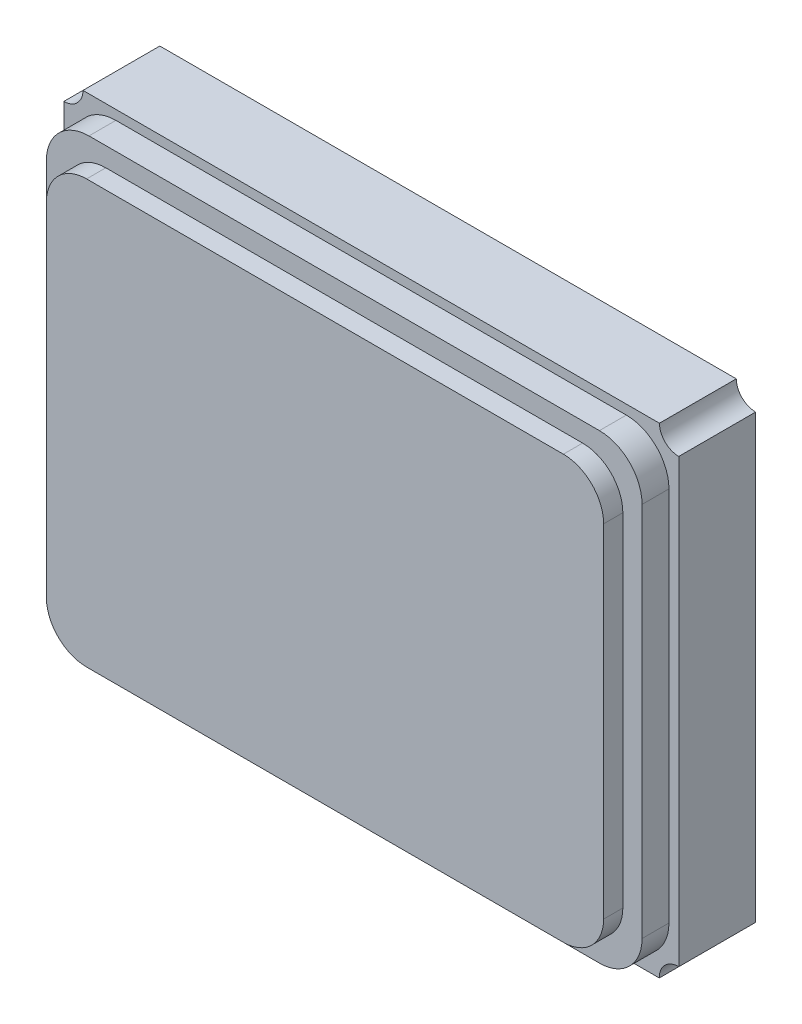
ISO-10303-21;
HEADER;
FILE_DESCRIPTION(('STEP AP214'),'2;1');
FILE_NAME('part.step','',(''),(''),'','','');
FILE_SCHEMA(('AUTOMOTIVE_DESIGN { 1 0 10303 214 1 1 1 1 }'));
ENDSEC;
DATA;
#1=APPLICATION_CONTEXT('core data for automotive mechanical design processes');
#2=APPLICATION_PROTOCOL_DEFINITION('international standard','automotive_design',2000,#1);
#3=PRODUCT_CONTEXT('',#1,'mechanical');
#4=PRODUCT('Part','Part','',(#3));
#5=PRODUCT_RELATED_PRODUCT_CATEGORY('part','',(#4));
#6=PRODUCT_DEFINITION_FORMATION('','',#4);
#7=PRODUCT_DEFINITION_CONTEXT('part definition',#1,'design');
#8=PRODUCT_DEFINITION('design','',#6,#7);
#9=PRODUCT_DEFINITION_SHAPE('','',#8);
#10=(LENGTH_UNIT() NAMED_UNIT(*) SI_UNIT(.MILLI.,.METRE.));
#11=(NAMED_UNIT(*) PLANE_ANGLE_UNIT() SI_UNIT($,.RADIAN.));
#12=(NAMED_UNIT(*) SI_UNIT($,.STERADIAN.) SOLID_ANGLE_UNIT());
#13=UNCERTAINTY_MEASURE_WITH_UNIT(LENGTH_MEASURE(1.E-05),#10,'distance_accuracy_value','');
#14=(GEOMETRIC_REPRESENTATION_CONTEXT(3) GLOBAL_UNCERTAINTY_ASSIGNED_CONTEXT((#13)) GLOBAL_UNIT_ASSIGNED_CONTEXT((#10,
#11,#12)) REPRESENTATION_CONTEXT('',''));
#15=CARTESIAN_POINT('',(0.,0.,0.));
#16=DIRECTION('',(0.,0.,1.));
#17=DIRECTION('',(1.,0.,0.));
#18=AXIS2_PLACEMENT_3D('',#15,#16,#17);
#19=CARTESIAN_POINT('',(0.0008802163144183,-0.0008850774637298,0.));
#20=DIRECTION('',(0.,0.,1.));
#21=DIRECTION('',(1.,0.,0.));
#22=AXIS2_PLACEMENT_3D('',#19,#20,#21);
#23=PLANE('',#22);
#24=DIRECTION('',(1.,0.,0.));
#25=VECTOR('',#24,1.);
#26=CARTESIAN_POINT('',(-1.499580396422,1.249506131818,0.));
#27=LINE('',#26,#25);
#28=CARTESIAN_POINT('',(-1.499580396422,1.249506131818,0.));
#29=VERTEX_POINT('',#28);
#30=CARTESIAN_POINT('',(1.500419603578,1.249506131818,0.));
#31=VERTEX_POINT('',#30);
#32=EDGE_CURVE('E376',#29,#31,#27,.T.);
#33=ORIENTED_EDGE('',*,*,#32,.T.);
#34=CARTESIAN_POINT('',(1.600419603578,1.250214196517,0.));
#35=DIRECTION('',(0.,0.,1.));
#36=DIRECTION('',(1.,0.,0.));
#37=AXIS2_PLACEMENT_3D('',#34,#35,#36);
#38=CIRCLE('',#37,0.100002506747);
#39=CARTESIAN_POINT('',(1.601127668277,1.150214196517,0.));
#40=VERTEX_POINT('',#39);
#41=EDGE_CURVE('E147',#31,#40,#38,.T.);
#42=ORIENTED_EDGE('',*,*,#41,.T.);
#43=DIRECTION('',(0.,-1.,0.));
#44=VECTOR('',#43,1.);
#45=CARTESIAN_POINT('',(1.601127668277,1.150214196517,0.));
#46=LINE('',#45,#44);
#47=CARTESIAN_POINT('',(1.601127668277,-1.149785803483,0.));
#48=VERTEX_POINT('',#47);
#49=EDGE_CURVE('E357',#40,#48,#46,.T.);
#50=ORIENTED_EDGE('',*,*,#49,.T.);
#51=CARTESIAN_POINT('',(1.599580396422,-1.249785803483,0.));
#52=DIRECTION('',(0.,0.,1.));
#53=DIRECTION('',(1.,0.,0.));
#54=AXIS2_PLACEMENT_3D('',#51,#52,#53);
#55=CIRCLE('',#54,0.100011969535);
#56=CARTESIAN_POINT('',(1.499580396422,-1.251333075338,0.));
#57=VERTEX_POINT('',#56);
#58=EDGE_CURVE('E28',#48,#57,#55,.T.);
#59=ORIENTED_EDGE('',*,*,#58,.T.);
#60=DIRECTION('',(-1.,0.,0.));
#61=VECTOR('',#60,1.);
#62=CARTESIAN_POINT('',(1.499580396422,-1.251333075338,0.));
#63=LINE('',#62,#61);
#64=CARTESIAN_POINT('',(-1.500419603578,-1.251333075338,0.));
#65=VERTEX_POINT('',#64);
#66=EDGE_CURVE('E11',#57,#65,#63,.T.);
#67=ORIENTED_EDGE('',*,*,#66,.T.);
#68=CARTESIAN_POINT('',(-1.600419603578,-1.250214196517,0.));
#69=DIRECTION('',(0.,0.,1.));
#70=DIRECTION('',(1.,0.,0.));
#71=AXIS2_PLACEMENT_3D('',#68,#69,#70);
#72=CIRCLE('',#71,0.100006259253);
#73=CARTESIAN_POINT('',(-1.599300724757,-1.150214196517,0.));
#74=VERTEX_POINT('',#73);
#75=EDGE_CURVE('E324',#65,#74,#72,.T.);
#76=ORIENTED_EDGE('',*,*,#75,.T.);
#77=DIRECTION('',(0.,1.,0.));
#78=VECTOR('',#77,1.);
#79=CARTESIAN_POINT('',(-1.599300724757,-1.150214196517,0.));
#80=LINE('',#79,#78);
#81=CARTESIAN_POINT('',(-1.599300724757,1.149785803483,0.));
#82=VERTEX_POINT('',#81);
#83=EDGE_CURVE('E349',#74,#82,#80,.T.);
#84=ORIENTED_EDGE('',*,*,#83,.T.);
#85=CARTESIAN_POINT('',(-1.599580396422,1.249785803483,0.));
#86=DIRECTION('',(0.,0.,1.));
#87=DIRECTION('',(1.,0.,0.));
#88=AXIS2_PLACEMENT_3D('',#85,#86,#87);
#89=CIRCLE('',#88,0.10000039108);
#90=EDGE_CURVE('E158',#82,#29,#89,.T.);
#91=ORIENTED_EDGE('',*,*,#90,.T.);
#92=EDGE_LOOP('',(#33,#42,#50,#59,#67,#76,#84,#91));
#93=FACE_BOUND('',#92,.T.);
#94=ADVANCED_FACE('F17',(#93),#23,.F.);
#95=CARTESIAN_POINT('',(1.499580396422,-1.251333075338,0.));
#96=DIRECTION('',(0.,-1.,0.));
#97=DIRECTION('',(0.,0.,-1.));
#98=AXIS2_PLACEMENT_3D('',#95,#96,#97);
#99=PLANE('',#98);
#100=DIRECTION('',(0.,0.,1.));
#101=VECTOR('',#100,1.);
#102=CARTESIAN_POINT('',(1.499580396422,-1.251333075338,0.));
#103=LINE('',#102,#101);
#104=CARTESIAN_POINT('',(1.499580396422,-1.251333075338,0.4));
#105=VERTEX_POINT('',#104);
#106=EDGE_CURVE('E174',#57,#105,#103,.T.);
#107=ORIENTED_EDGE('',*,*,#106,.T.);
#108=DIRECTION('',(-1.,0.,0.));
#109=VECTOR('',#108,1.);
#110=CARTESIAN_POINT('',(1.499580396422,-1.251333075338,0.4));
#111=LINE('',#110,#109);
#112=CARTESIAN_POINT('',(-1.500419603578,-1.251333075338,0.4));
#113=VERTEX_POINT('',#112);
#114=EDGE_CURVE('E304',#105,#113,#111,.T.);
#115=ORIENTED_EDGE('',*,*,#114,.T.);
#116=DIRECTION('',(0.,0.,1.));
#117=VECTOR('',#116,1.);
#118=CARTESIAN_POINT('',(-1.500419603578,-1.251333075338,0.));
#119=LINE('',#118,#117);
#120=EDGE_CURVE('E21',#65,#113,#119,.T.);
#121=ORIENTED_EDGE('',*,*,#120,.F.);
#122=ORIENTED_EDGE('',*,*,#66,.F.);
#123=EDGE_LOOP('',(#107,#115,#121,#122));
#124=FACE_BOUND('',#123,.T.);
#125=ADVANCED_FACE('F599',(#124),#99,.T.);
#126=CARTESIAN_POINT('',(1.599580396422,-1.249785803483,0.));
#127=DIRECTION('',(0.,0.,-1.));
#128=DIRECTION('',(1.,0.,0.));
#129=AXIS2_PLACEMENT_3D('',#126,#127,#128);
#130=CYLINDRICAL_SURFACE('',#129,0.100011969535);
#131=DIRECTION('',(0.,0.,1.));
#132=VECTOR('',#131,1.);
#133=CARTESIAN_POINT('',(1.601127668277,-1.149785803483,0.));
#134=LINE('',#133,#132);
#135=CARTESIAN_POINT('',(1.601127668277,-1.149785803483,0.4));
#136=VERTEX_POINT('',#135);
#137=EDGE_CURVE('E354',#48,#136,#134,.T.);
#138=ORIENTED_EDGE('',*,*,#137,.T.);
#139=CARTESIAN_POINT('',(1.599580396422,-1.249785803483,0.4));
#140=DIRECTION('',(0.,0.,1.));
#141=DIRECTION('',(1.,0.,0.));
#142=AXIS2_PLACEMENT_3D('',#139,#140,#141);
#143=CIRCLE('',#142,0.100011969535);
#144=EDGE_CURVE('E307',#136,#105,#143,.T.);
#145=ORIENTED_EDGE('',*,*,#144,.T.);
#146=ORIENTED_EDGE('',*,*,#106,.F.);
#147=ORIENTED_EDGE('',*,*,#58,.F.);
#148=EDGE_LOOP('',(#138,#145,#146,#147));
#149=FACE_BOUND('',#148,.T.);
#150=ADVANCED_FACE('F604',(#149),#130,.F.);
#151=CARTESIAN_POINT('',(-1.600419603578,-1.250214196517,0.));
#152=DIRECTION('',(0.,0.,-1.));
#153=DIRECTION('',(1.,0.,0.));
#154=AXIS2_PLACEMENT_3D('',#151,#152,#153);
#155=CYLINDRICAL_SURFACE('',#154,0.100006259253);
#156=ORIENTED_EDGE('',*,*,#120,.T.);
#157=CARTESIAN_POINT('',(-1.600419603578,-1.250214196517,0.4));
#158=DIRECTION('',(0.,0.,1.));
#159=DIRECTION('',(1.,0.,0.));
#160=AXIS2_PLACEMENT_3D('',#157,#158,#159);
#161=CIRCLE('',#160,0.100006259253);
#162=CARTESIAN_POINT('',(-1.599300724757,-1.150214196517,0.4));
#163=VERTEX_POINT('',#162);
#164=EDGE_CURVE('E308',#113,#163,#161,.T.);
#165=ORIENTED_EDGE('',*,*,#164,.T.);
#166=DIRECTION('',(0.,0.,1.));
#167=VECTOR('',#166,1.);
#168=CARTESIAN_POINT('',(-1.599300724757,-1.150214196517,0.));
#169=LINE('',#168,#167);
#170=EDGE_CURVE('E346',#74,#163,#169,.T.);
#171=ORIENTED_EDGE('',*,*,#170,.F.);
#172=ORIENTED_EDGE('',*,*,#75,.F.);
#173=EDGE_LOOP('',(#156,#165,#171,#172));
#174=FACE_BOUND('',#173,.T.);
#175=ADVANCED_FACE('F629',(#174),#155,.F.);
#176=CARTESIAN_POINT('',(1.601127668277,1.150214196517,0.));
#177=DIRECTION('',(1.,0.,0.));
#178=DIRECTION('',(0.,1.,0.));
#179=AXIS2_PLACEMENT_3D('',#176,#177,#178);
#180=PLANE('',#179);
#181=DIRECTION('',(0.,0.,1.));
#182=VECTOR('',#181,1.);
#183=CARTESIAN_POINT('',(1.601127668277,1.150214196517,0.));
#184=LINE('',#183,#182);
#185=CARTESIAN_POINT('',(1.601127668277,1.150214196517,0.4));
#186=VERTEX_POINT('',#185);
#187=EDGE_CURVE('E319',#40,#186,#184,.T.);
#188=ORIENTED_EDGE('',*,*,#187,.T.);
#189=DIRECTION('',(0.,-1.,0.));
#190=VECTOR('',#189,1.);
#191=CARTESIAN_POINT('',(1.601127668277,1.150214196517,0.4));
#192=LINE('',#191,#190);
#193=EDGE_CURVE('E314',#186,#136,#192,.T.);
#194=ORIENTED_EDGE('',*,*,#193,.T.);
#195=ORIENTED_EDGE('',*,*,#137,.F.);
#196=ORIENTED_EDGE('',*,*,#49,.F.);
#197=EDGE_LOOP('',(#188,#194,#195,#196));
#198=FACE_BOUND('',#197,.T.);
#199=ADVANCED_FACE('F608',(#198),#180,.T.);
#200=CARTESIAN_POINT('',(-1.599300724757,-1.150214196517,0.));
#201=DIRECTION('',(-1.,0.,0.));
#202=DIRECTION('',(0.,0.,1.));
#203=AXIS2_PLACEMENT_3D('',#200,#201,#202);
#204=PLANE('',#203);
#205=ORIENTED_EDGE('',*,*,#170,.T.);
#206=DIRECTION('',(0.,1.,0.));
#207=VECTOR('',#206,1.);
#208=CARTESIAN_POINT('',(-1.599300724757,-1.150214196517,0.4));
#209=LINE('',#208,#207);
#210=CARTESIAN_POINT('',(-1.599300724757,1.149785803483,0.4));
#211=VERTEX_POINT('',#210);
#212=EDGE_CURVE('E362',#163,#211,#209,.T.);
#213=ORIENTED_EDGE('',*,*,#212,.T.);
#214=DIRECTION('',(0.,0.,1.));
#215=VECTOR('',#214,1.);
#216=CARTESIAN_POINT('',(-1.599300724757,1.149785803483,0.));
#217=LINE('',#216,#215);
#218=EDGE_CURVE('E379',#82,#211,#217,.T.);
#219=ORIENTED_EDGE('',*,*,#218,.F.);
#220=ORIENTED_EDGE('',*,*,#83,.F.);
#221=EDGE_LOOP('',(#205,#213,#219,#220));
#222=FACE_BOUND('',#221,.T.);
#223=ADVANCED_FACE('F644',(#222),#204,.T.);
#224=CARTESIAN_POINT('',(1.600419603578,1.250214196517,0.));
#225=DIRECTION('',(0.,0.,-1.));
#226=DIRECTION('',(1.,0.,0.));
#227=AXIS2_PLACEMENT_3D('',#224,#225,#226);
#228=CYLINDRICAL_SURFACE('',#227,0.100002506747);
#229=DIRECTION('',(0.,0.,1.));
#230=VECTOR('',#229,1.);
#231=CARTESIAN_POINT('',(1.500419603578,1.249506131818,0.));
#232=LINE('',#231,#230);
#233=CARTESIAN_POINT('',(1.500419603578,1.249506131818,0.4));
#234=VERTEX_POINT('',#233);
#235=EDGE_CURVE('E380',#31,#234,#232,.T.);
#236=ORIENTED_EDGE('',*,*,#235,.T.);
#237=CARTESIAN_POINT('',(1.600419603578,1.250214196517,0.4));
#238=DIRECTION('',(0.,0.,1.));
#239=DIRECTION('',(1.,0.,0.));
#240=AXIS2_PLACEMENT_3D('',#237,#238,#239);
#241=CIRCLE('',#240,0.100002506747);
#242=EDGE_CURVE('E318',#234,#186,#241,.T.);
#243=ORIENTED_EDGE('',*,*,#242,.T.);
#244=ORIENTED_EDGE('',*,*,#187,.F.);
#245=ORIENTED_EDGE('',*,*,#41,.F.);
#246=EDGE_LOOP('',(#236,#243,#244,#245));
#247=FACE_BOUND('',#246,.T.);
#248=ADVANCED_FACE('F466',(#247),#228,.F.);
#249=CARTESIAN_POINT('',(-1.599580396422,1.249785803483,0.));
#250=DIRECTION('',(0.,0.,-1.));
#251=DIRECTION('',(1.,0.,0.));
#252=AXIS2_PLACEMENT_3D('',#249,#250,#251);
#253=CYLINDRICAL_SURFACE('',#252,0.10000039108);
#254=ORIENTED_EDGE('',*,*,#218,.T.);
#255=CARTESIAN_POINT('',(-1.599580396422,1.249785803483,0.4));
#256=DIRECTION('',(0.,0.,1.));
#257=DIRECTION('',(1.,0.,0.));
#258=AXIS2_PLACEMENT_3D('',#255,#256,#257);
#259=CIRCLE('',#258,0.10000039108);
#260=CARTESIAN_POINT('',(-1.499580396422,1.249506131818,0.4));
#261=VERTEX_POINT('',#260);
#262=EDGE_CURVE('E358',#211,#261,#259,.T.);
#263=ORIENTED_EDGE('',*,*,#262,.T.);
#264=DIRECTION('',(0.,0.,1.));
#265=VECTOR('',#264,1.);
#266=CARTESIAN_POINT('',(-1.499580396422,1.249506131818,0.));
#267=LINE('',#266,#265);
#268=EDGE_CURVE('E395',#29,#261,#267,.T.);
#269=ORIENTED_EDGE('',*,*,#268,.F.);
#270=ORIENTED_EDGE('',*,*,#90,.F.);
#271=EDGE_LOOP('',(#254,#263,#269,#270));
#272=FACE_BOUND('',#271,.T.);
#273=ADVANCED_FACE('F477',(#272),#253,.F.);
#274=CARTESIAN_POINT('',(-1.499580396422,1.249506131818,0.));
#275=DIRECTION('',(0.,1.,0.));
#276=DIRECTION('',(1.,0.,0.));
#277=AXIS2_PLACEMENT_3D('',#274,#275,#276);
#278=PLANE('',#277);
#279=ORIENTED_EDGE('',*,*,#268,.T.);
#280=DIRECTION('',(1.,0.,0.));
#281=VECTOR('',#280,1.);
#282=CARTESIAN_POINT('',(-1.499580396422,1.249506131818,0.4));
#283=LINE('',#282,#281);
#284=EDGE_CURVE('E363',#261,#234,#283,.T.);
#285=ORIENTED_EDGE('',*,*,#284,.T.);
#286=ORIENTED_EDGE('',*,*,#235,.F.);
#287=ORIENTED_EDGE('',*,*,#32,.F.);
#288=EDGE_LOOP('',(#279,#285,#286,#287));
#289=FACE_BOUND('',#288,.T.);
#290=ADVANCED_FACE('F474',(#289),#278,.T.);
#291=CARTESIAN_POINT('',(0.0008802163144183,-0.0008850774637298,0.4));
#292=DIRECTION('',(0.,0.,1.));
#293=DIRECTION('',(1.,0.,0.));
#294=AXIS2_PLACEMENT_3D('',#291,#292,#293);
#295=PLANE('',#294);
#296=CARTESIAN_POINT('',(1.328205850256,-0.978205850256,0.4));
#297=DIRECTION('',(0.,0.,-1.));
#298=DIRECTION('',(1.,0.,0.));
#299=AXIS2_PLACEMENT_3D('',#296,#297,#298);
#300=CIRCLE('',#299,0.221794149744);
#301=CARTESIAN_POINT('',(1.55,-0.978205850256,0.4));
#302=VERTEX_POINT('',#301);
#303=CARTESIAN_POINT('',(1.328205850256,-1.2,0.4));
#304=VERTEX_POINT('',#303);
#305=EDGE_CURVE('E266',#302,#304,#300,.T.);
#306=ORIENTED_EDGE('',*,*,#305,.T.);
#307=DIRECTION('',(-1.,0.,0.));
#308=VECTOR('',#307,1.);
#309=CARTESIAN_POINT('',(-0.663662816971,-1.2,0.4));
#310=LINE('',#309,#308);
#311=CARTESIAN_POINT('',(-1.328205850256,-1.2,0.4));
#312=VERTEX_POINT('',#311);
#313=EDGE_CURVE('E429',#304,#312,#310,.T.);
#314=ORIENTED_EDGE('',*,*,#313,.T.);
#315=CARTESIAN_POINT('',(-1.328205850256,-0.978205850256,0.4));
#316=DIRECTION('',(0.,0.,-1.));
#317=DIRECTION('',(1.,0.,0.));
#318=AXIS2_PLACEMENT_3D('',#315,#316,#317);
#319=CIRCLE('',#318,0.221794149744);
#320=CARTESIAN_POINT('',(-1.55,-0.978205850256,0.4));
#321=VERTEX_POINT('',#320);
#322=EDGE_CURVE('E303',#312,#321,#319,.T.);
#323=ORIENTED_EDGE('',*,*,#322,.T.);
#324=DIRECTION('',(0.,1.,0.));
#325=VECTOR('',#324,1.);
#326=CARTESIAN_POINT('',(-1.55,0.488660386396,0.4));
#327=LINE('',#326,#325);
#328=CARTESIAN_POINT('',(-1.55,0.978205850256,0.4));
#329=VERTEX_POINT('',#328);
#330=EDGE_CURVE('E265',#321,#329,#327,.T.);
#331=ORIENTED_EDGE('',*,*,#330,.T.);
#332=CARTESIAN_POINT('',(-1.328205850256,0.978205850256,0.4));
#333=DIRECTION('',(0.,0.,-1.));
#334=DIRECTION('',(1.,0.,0.));
#335=AXIS2_PLACEMENT_3D('',#332,#333,#334);
#336=CIRCLE('',#335,0.221794149744);
#337=CARTESIAN_POINT('',(-1.328205850256,1.2,0.4));
#338=VERTEX_POINT('',#337);
#339=EDGE_CURVE('E261',#329,#338,#336,.T.);
#340=ORIENTED_EDGE('',*,*,#339,.T.);
#341=DIRECTION('',(1.,0.,0.));
#342=VECTOR('',#341,1.);
#343=CARTESIAN_POINT('',(0.664543033285,1.2,0.4));
#344=LINE('',#343,#342);
#345=CARTESIAN_POINT('',(1.328205850256,1.2,0.4));
#346=VERTEX_POINT('',#345);
#347=EDGE_CURVE('E401',#338,#346,#344,.T.);
#348=ORIENTED_EDGE('',*,*,#347,.T.);
#349=CARTESIAN_POINT('',(1.328205850256,0.978205850256,0.4));
#350=DIRECTION('',(0.,0.,-1.));
#351=DIRECTION('',(1.,0.,0.));
#352=AXIS2_PLACEMENT_3D('',#349,#350,#351);
#353=CIRCLE('',#352,0.221794149744);
#354=CARTESIAN_POINT('',(1.55,0.978205850256,0.4));
#355=VERTEX_POINT('',#354);
#356=EDGE_CURVE('E397',#346,#355,#353,.T.);
#357=ORIENTED_EDGE('',*,*,#356,.T.);
#358=DIRECTION('',(0.,-1.,0.));
#359=VECTOR('',#358,1.);
#360=CARTESIAN_POINT('',(1.55,-0.48954546386,0.4));
#361=LINE('',#360,#359);
#362=EDGE_CURVE('E342',#355,#302,#361,.T.);
#363=ORIENTED_EDGE('',*,*,#362,.T.);
#364=EDGE_LOOP('',(#306,#314,#323,#331,#340,#348,#357,#363));
#365=FACE_BOUND('',#364,.T.);
#366=ORIENTED_EDGE('',*,*,#284,.F.);
#367=ORIENTED_EDGE('',*,*,#262,.F.);
#368=ORIENTED_EDGE('',*,*,#212,.F.);
#369=ORIENTED_EDGE('',*,*,#164,.F.);
#370=ORIENTED_EDGE('',*,*,#114,.F.);
#371=ORIENTED_EDGE('',*,*,#144,.F.);
#372=ORIENTED_EDGE('',*,*,#193,.F.);
#373=ORIENTED_EDGE('',*,*,#242,.F.);
#374=EDGE_LOOP('',(#366,#367,#368,#369,#370,#371,#372,#373));
#375=FACE_BOUND('',#374,.T.);
#376=ADVANCED_FACE('F471',(#365,#375),#295,.T.);
#377=CARTESIAN_POINT('',(1.328205850256,1.2,0.39));
#378=DIRECTION('',(0.,-1.,0.));
#379=DIRECTION('',(0.,0.,-1.));
#380=AXIS2_PLACEMENT_3D('',#377,#378,#379);
#381=PLANE('',#380);
#382=DIRECTION('',(0.,0.,1.));
#383=VECTOR('',#382,1.);
#384=CARTESIAN_POINT('',(-1.328205850256,1.2,0.39));
#385=LINE('',#384,#383);
#386=CARTESIAN_POINT('',(-1.328205850256,1.2,0.54));
#387=VERTEX_POINT('',#386);
#388=EDGE_CURVE('E345',#338,#387,#385,.T.);
#389=ORIENTED_EDGE('',*,*,#388,.T.);
#390=DIRECTION('',(-1.,0.,0.));
#391=VECTOR('',#390,1.);
#392=CARTESIAN_POINT('',(1.328205850256,1.2,0.54));
#393=LINE('',#392,#391);
#394=CARTESIAN_POINT('',(1.328205850256,1.2,0.54));
#395=VERTEX_POINT('',#394);
#396=EDGE_CURVE('E283',#395,#387,#393,.T.);
#397=ORIENTED_EDGE('',*,*,#396,.F.);
#398=DIRECTION('',(0.,0.,1.));
#399=VECTOR('',#398,1.);
#400=CARTESIAN_POINT('',(1.328205850256,1.2,0.39));
#401=LINE('',#400,#399);
#402=EDGE_CURVE('E402',#346,#395,#401,.T.);
#403=ORIENTED_EDGE('',*,*,#402,.F.);
#404=ORIENTED_EDGE('',*,*,#347,.F.);
#405=EDGE_LOOP('',(#389,#397,#403,#404));
#406=FACE_BOUND('',#405,.T.);
#407=ADVANCED_FACE('F531',(#406),#381,.F.);
#408=CARTESIAN_POINT('',(1.328205850256,0.978205850256,0.39));
#409=DIRECTION('',(0.,0.,-1.));
#410=DIRECTION('',(1.,0.,0.));
#411=AXIS2_PLACEMENT_3D('',#408,#409,#410);
#412=CYLINDRICAL_SURFACE('',#411,0.221794149744);
#413=ORIENTED_EDGE('',*,*,#402,.T.);
#414=CARTESIAN_POINT('',(1.328205850256,0.978205850256,0.54));
#415=DIRECTION('',(0.,0.,1.));
#416=DIRECTION('',(1.,0.,0.));
#417=AXIS2_PLACEMENT_3D('',#414,#415,#416);
#418=CIRCLE('',#417,0.221794149744);
#419=CARTESIAN_POINT('',(1.55,0.978205850256,0.54));
#420=VERTEX_POINT('',#419);
#421=EDGE_CURVE('E289',#420,#395,#418,.T.);
#422=ORIENTED_EDGE('',*,*,#421,.F.);
#423=DIRECTION('',(0.,0.,1.));
#424=VECTOR('',#423,1.);
#425=CARTESIAN_POINT('',(1.55,0.978205850256,0.39));
#426=LINE('',#425,#424);
#427=EDGE_CURVE('E327',#355,#420,#426,.T.);
#428=ORIENTED_EDGE('',*,*,#427,.F.);
#429=ORIENTED_EDGE('',*,*,#356,.F.);
#430=EDGE_LOOP('',(#413,#422,#428,#429));
#431=FACE_BOUND('',#430,.T.);
#432=ADVANCED_FACE('F528',(#431),#412,.T.);
#433=CARTESIAN_POINT('',(-1.328205850256,0.978205850256,0.39));
#434=DIRECTION('',(0.,0.,-1.));
#435=DIRECTION('',(1.,0.,0.));
#436=AXIS2_PLACEMENT_3D('',#433,#434,#435);
#437=CYLINDRICAL_SURFACE('',#436,0.221794149744);
#438=DIRECTION('',(0.,0.,1.));
#439=VECTOR('',#438,1.);
#440=CARTESIAN_POINT('',(-1.55,0.978205850256,0.39));
#441=LINE('',#440,#439);
#442=CARTESIAN_POINT('',(-1.55,0.978205850256,0.54));
#443=VERTEX_POINT('',#442);
#444=EDGE_CURVE('E253',#329,#443,#441,.T.);
#445=ORIENTED_EDGE('',*,*,#444,.T.);
#446=CARTESIAN_POINT('',(-1.328205850256,0.978205850256,0.54));
#447=DIRECTION('',(0.,0.,1.));
#448=DIRECTION('',(1.,0.,0.));
#449=AXIS2_PLACEMENT_3D('',#446,#447,#448);
#450=CIRCLE('',#449,0.221794149744);
#451=EDGE_CURVE('E258',#387,#443,#450,.T.);
#452=ORIENTED_EDGE('',*,*,#451,.F.);
#453=ORIENTED_EDGE('',*,*,#388,.F.);
#454=ORIENTED_EDGE('',*,*,#339,.F.);
#455=EDGE_LOOP('',(#445,#452,#453,#454));
#456=FACE_BOUND('',#455,.T.);
#457=ADVANCED_FACE('F255',(#456),#437,.T.);
#458=CARTESIAN_POINT('',(1.55,-0.978205850256,0.39));
#459=DIRECTION('',(-1.,0.,0.));
#460=DIRECTION('',(0.,0.,1.));
#461=AXIS2_PLACEMENT_3D('',#458,#459,#460);
#462=PLANE('',#461);
#463=ORIENTED_EDGE('',*,*,#427,.T.);
#464=DIRECTION('',(0.,1.,0.));
#465=VECTOR('',#464,1.);
#466=CARTESIAN_POINT('',(1.55,-0.978205850256,0.54));
#467=LINE('',#466,#465);
#468=CARTESIAN_POINT('',(1.55,-0.978205850256,0.54));
#469=VERTEX_POINT('',#468);
#470=EDGE_CURVE('E292',#469,#420,#467,.T.);
#471=ORIENTED_EDGE('',*,*,#470,.F.);
#472=DIRECTION('',(0.,0.,1.));
#473=VECTOR('',#472,1.);
#474=CARTESIAN_POINT('',(1.55,-0.978205850256,0.39));
#475=LINE('',#474,#473);
#476=EDGE_CURVE('E207',#302,#469,#475,.T.);
#477=ORIENTED_EDGE('',*,*,#476,.F.);
#478=ORIENTED_EDGE('',*,*,#362,.F.);
#479=EDGE_LOOP('',(#463,#471,#477,#478));
#480=FACE_BOUND('',#479,.T.);
#481=ADVANCED_FACE('F523',(#480),#462,.F.);
#482=CARTESIAN_POINT('',(-1.55,0.978205850256,0.39));
#483=DIRECTION('',(1.,0.,0.));
#484=DIRECTION('',(0.,1.,0.));
#485=AXIS2_PLACEMENT_3D('',#482,#483,#484);
#486=PLANE('',#485);
#487=DIRECTION('',(0.,0.,1.));
#488=VECTOR('',#487,1.);
#489=CARTESIAN_POINT('',(-1.55,-0.978205850256,0.39));
#490=LINE('',#489,#488);
#491=CARTESIAN_POINT('',(-1.55,-0.978205850256,0.54));
#492=VERTEX_POINT('',#491);
#493=EDGE_CURVE('E272',#321,#492,#490,.T.);
#494=ORIENTED_EDGE('',*,*,#493,.T.);
#495=DIRECTION('',(0.,-1.,0.));
#496=VECTOR('',#495,1.);
#497=CARTESIAN_POINT('',(-1.55,0.978205850256,0.54));
#498=LINE('',#497,#496);
#499=EDGE_CURVE('E269',#443,#492,#498,.T.);
#500=ORIENTED_EDGE('',*,*,#499,.F.);
#501=ORIENTED_EDGE('',*,*,#444,.F.);
#502=ORIENTED_EDGE('',*,*,#330,.F.);
#503=EDGE_LOOP('',(#494,#500,#501,#502));
#504=FACE_BOUND('',#503,.T.);
#505=ADVANCED_FACE('F270',(#504),#486,.F.);
#506=CARTESIAN_POINT('',(1.328205850256,-0.978205850256,0.39));
#507=DIRECTION('',(0.,0.,-1.));
#508=DIRECTION('',(1.,0.,0.));
#509=AXIS2_PLACEMENT_3D('',#506,#507,#508);
#510=CYLINDRICAL_SURFACE('',#509,0.221794149744);
#511=ORIENTED_EDGE('',*,*,#476,.T.);
#512=CARTESIAN_POINT('',(1.328205850256,-0.978205850256,0.54));
#513=DIRECTION('',(0.,0.,1.));
#514=DIRECTION('',(1.,0.,0.));
#515=AXIS2_PLACEMENT_3D('',#512,#513,#514);
#516=CIRCLE('',#515,0.221794149744);
#517=CARTESIAN_POINT('',(1.328205850256,-1.2,0.54));
#518=VERTEX_POINT('',#517);
#519=EDGE_CURVE('E495',#518,#469,#516,.T.);
#520=ORIENTED_EDGE('',*,*,#519,.F.);
#521=DIRECTION('',(0.,0.,1.));
#522=VECTOR('',#521,1.);
#523=CARTESIAN_POINT('',(1.328205850256,-1.2,0.39));
#524=LINE('',#523,#522);
#525=EDGE_CURVE('E219',#304,#518,#524,.T.);
#526=ORIENTED_EDGE('',*,*,#525,.F.);
#527=ORIENTED_EDGE('',*,*,#305,.F.);
#528=EDGE_LOOP('',(#511,#520,#526,#527));
#529=FACE_BOUND('',#528,.T.);
#530=ADVANCED_FACE('F614',(#529),#510,.T.);
#531=CARTESIAN_POINT('',(-1.328205850256,-0.978205850256,0.39));
#532=DIRECTION('',(0.,0.,-1.));
#533=DIRECTION('',(1.,0.,0.));
#534=AXIS2_PLACEMENT_3D('',#531,#532,#533);
#535=CYLINDRICAL_SURFACE('',#534,0.221794149744);
#536=DIRECTION('',(0.,0.,1.));
#537=VECTOR('',#536,1.);
#538=CARTESIAN_POINT('',(-1.328205850256,-1.2,0.39));
#539=LINE('',#538,#537);
#540=CARTESIAN_POINT('',(-1.328205850256,-1.2,0.54));
#541=VERTEX_POINT('',#540);
#542=EDGE_CURVE('E433',#312,#541,#539,.T.);
#543=ORIENTED_EDGE('',*,*,#542,.T.);
#544=CARTESIAN_POINT('',(-1.328205850256,-0.978205850256,0.54));
#545=DIRECTION('',(0.,0.,1.));
#546=DIRECTION('',(1.,0.,0.));
#547=AXIS2_PLACEMENT_3D('',#544,#545,#546);
#548=CIRCLE('',#547,0.221794149744);
#549=EDGE_CURVE('E277',#492,#541,#548,.T.);
#550=ORIENTED_EDGE('',*,*,#549,.F.);
#551=ORIENTED_EDGE('',*,*,#493,.F.);
#552=ORIENTED_EDGE('',*,*,#322,.F.);
#553=EDGE_LOOP('',(#543,#550,#551,#552));
#554=FACE_BOUND('',#553,.T.);
#555=ADVANCED_FACE('F617',(#554),#535,.T.);
#556=CARTESIAN_POINT('',(-1.328205850256,-1.2,0.39));
#557=DIRECTION('',(0.,1.,0.));
#558=DIRECTION('',(1.,0.,0.));
#559=AXIS2_PLACEMENT_3D('',#556,#557,#558);
#560=PLANE('',#559);
#561=ORIENTED_EDGE('',*,*,#525,.T.);
#562=DIRECTION('',(1.,0.,0.));
#563=VECTOR('',#562,1.);
#564=CARTESIAN_POINT('',(-1.328205850256,-1.2,0.54));
#565=LINE('',#564,#563);
#566=EDGE_CURVE('E369',#541,#518,#565,.T.);
#567=ORIENTED_EDGE('',*,*,#566,.F.);
#568=ORIENTED_EDGE('',*,*,#542,.F.);
#569=ORIENTED_EDGE('',*,*,#313,.F.);
#570=EDGE_LOOP('',(#561,#567,#568,#569));
#571=FACE_BOUND('',#570,.T.);
#572=ADVANCED_FACE('F594',(#571),#560,.F.);
#573=CARTESIAN_POINT('',(0.,0.,0.54));
#574=DIRECTION('',(0.,0.,1.));
#575=DIRECTION('',(1.,0.,0.));
#576=AXIS2_PLACEMENT_3D('',#573,#574,#575);
#577=PLANE('',#576);
#578=DIRECTION('',(1.,0.,0.));
#579=VECTOR('',#578,1.);
#580=CARTESIAN_POINT('',(-1.240692780974,-1.1,0.54));
#581=LINE('',#580,#579);
#582=CARTESIAN_POINT('',(-1.240692780974,-1.1,0.54));
#583=VERTEX_POINT('',#582);
#584=CARTESIAN_POINT('',(1.240692780974,-1.1,0.54));
#585=VERTEX_POINT('',#584);
#586=EDGE_CURVE('E387',#583,#585,#581,.T.);
#587=ORIENTED_EDGE('',*,*,#586,.F.);
#588=CARTESIAN_POINT('',(-1.240692780974,-0.890692780974,0.54));
#589=DIRECTION('',(0.,0.,1.));
#590=DIRECTION('',(1.,0.,0.));
#591=AXIS2_PLACEMENT_3D('',#588,#589,#590);
#592=CIRCLE('',#591,0.209307219026);
#593=CARTESIAN_POINT('',(-1.45,-0.890692780974,0.54));
#594=VERTEX_POINT('',#593);
#595=EDGE_CURVE('E366',#594,#583,#592,.T.);
#596=ORIENTED_EDGE('',*,*,#595,.F.);
#597=DIRECTION('',(0.,-1.,0.));
#598=VECTOR('',#597,1.);
#599=CARTESIAN_POINT('',(-1.45,0.890692780974,0.54));
#600=LINE('',#599,#598);
#601=CARTESIAN_POINT('',(-1.45,0.890692780974,0.54));
#602=VERTEX_POINT('',#601);
#603=EDGE_CURVE('E411',#602,#594,#600,.T.);
#604=ORIENTED_EDGE('',*,*,#603,.F.);
#605=CARTESIAN_POINT('',(-1.240692780974,0.890692780974,0.54));
#606=DIRECTION('',(0.,0.,1.));
#607=DIRECTION('',(1.,0.,0.));
#608=AXIS2_PLACEMENT_3D('',#605,#606,#607);
#609=CIRCLE('',#608,0.209307219026);
#610=CARTESIAN_POINT('',(-1.240692780974,1.1,0.54));
#611=VERTEX_POINT('',#610);
#612=EDGE_CURVE('E312',#611,#602,#609,.T.);
#613=ORIENTED_EDGE('',*,*,#612,.F.);
#614=DIRECTION('',(-1.,0.,0.));
#615=VECTOR('',#614,1.);
#616=CARTESIAN_POINT('',(1.240692780974,1.1,0.54));
#617=LINE('',#616,#615);
#618=CARTESIAN_POINT('',(1.240692780974,1.1,0.54));
#619=VERTEX_POINT('',#618);
#620=EDGE_CURVE('E313',#619,#611,#617,.T.);
#621=ORIENTED_EDGE('',*,*,#620,.F.);
#622=CARTESIAN_POINT('',(1.240692780974,0.890692780974,0.54));
#623=DIRECTION('',(0.,0.,1.));
#624=DIRECTION('',(1.,0.,0.));
#625=AXIS2_PLACEMENT_3D('',#622,#623,#624);
#626=CIRCLE('',#625,0.209307219026);
#627=CARTESIAN_POINT('',(1.45,0.890692780974,0.54));
#628=VERTEX_POINT('',#627);
#629=EDGE_CURVE('E336',#628,#619,#626,.T.);
#630=ORIENTED_EDGE('',*,*,#629,.F.);
#631=DIRECTION('',(0.,1.,0.));
#632=VECTOR('',#631,1.);
#633=CARTESIAN_POINT('',(1.45,-0.890692780974,0.54));
#634=LINE('',#633,#632);
#635=CARTESIAN_POINT('',(1.45,-0.890692780974,0.54));
#636=VERTEX_POINT('',#635);
#637=EDGE_CURVE('E350',#636,#628,#634,.T.);
#638=ORIENTED_EDGE('',*,*,#637,.F.);
#639=CARTESIAN_POINT('',(1.240692780974,-0.890692780974,0.54));
#640=DIRECTION('',(0.,0.,1.));
#641=DIRECTION('',(1.,0.,0.));
#642=AXIS2_PLACEMENT_3D('',#639,#640,#641);
#643=CIRCLE('',#642,0.209307219026);
#644=EDGE_CURVE('E330',#585,#636,#643,.T.);
#645=ORIENTED_EDGE('',*,*,#644,.F.);
#646=EDGE_LOOP('',(#587,#596,#604,#613,#621,#630,#638,#645));
#647=FACE_BOUND('',#646,.T.);
#648=ORIENTED_EDGE('',*,*,#566,.T.);
#649=ORIENTED_EDGE('',*,*,#519,.T.);
#650=ORIENTED_EDGE('',*,*,#470,.T.);
#651=ORIENTED_EDGE('',*,*,#421,.T.);
#652=ORIENTED_EDGE('',*,*,#396,.T.);
#653=ORIENTED_EDGE('',*,*,#451,.T.);
#654=ORIENTED_EDGE('',*,*,#499,.T.);
#655=ORIENTED_EDGE('',*,*,#549,.T.);
#656=EDGE_LOOP('',(#648,#649,#650,#651,#652,#653,#654,#655));
#657=FACE_BOUND('',#656,.T.);
#658=ADVANCED_FACE('F280',(#647,#657),#577,.T.);
#659=CARTESIAN_POINT('',(-1.240692780974,-0.890692780974,0.54));
#660=DIRECTION('',(0.,0.,-1.));
#661=DIRECTION('',(1.,0.,0.));
#662=AXIS2_PLACEMENT_3D('',#659,#660,#661);
#663=CYLINDRICAL_SURFACE('',#662,0.209307219026);
#664=ORIENTED_EDGE('',*,*,#595,.T.);
#665=DIRECTION('',(0.,0.,1.));
#666=VECTOR('',#665,1.);
#667=CARTESIAN_POINT('',(-1.240692780974,-1.1,0.54));
#668=LINE('',#667,#666);
#669=CARTESIAN_POINT('',(-1.240692780974,-1.1,0.64));
#670=VERTEX_POINT('',#669);
#671=EDGE_CURVE('E335',#583,#670,#668,.T.);
#672=ORIENTED_EDGE('',*,*,#671,.T.);
#673=CARTESIAN_POINT('',(-1.240692780974,-0.890692780974,0.64));
#674=DIRECTION('',(0.,0.,1.));
#675=DIRECTION('',(1.,0.,0.));
#676=AXIS2_PLACEMENT_3D('',#673,#674,#675);
#677=CIRCLE('',#676,0.209307219026);
#678=CARTESIAN_POINT('',(-1.45,-0.890692780974,0.64));
#679=VERTEX_POINT('',#678);
#680=EDGE_CURVE('E383',#679,#670,#677,.T.);
#681=ORIENTED_EDGE('',*,*,#680,.F.);
#682=DIRECTION('',(0.,0.,1.));
#683=VECTOR('',#682,1.);
#684=CARTESIAN_POINT('',(-1.45,-0.890692780974,0.54));
#685=LINE('',#684,#683);
#686=EDGE_CURVE('E370',#594,#679,#685,.T.);
#687=ORIENTED_EDGE('',*,*,#686,.F.);
#688=EDGE_LOOP('',(#664,#672,#681,#687));
#689=FACE_BOUND('',#688,.T.);
#690=ADVANCED_FACE('F585',(#689),#663,.T.);
#691=CARTESIAN_POINT('',(-1.45,0.890692780974,0.54));
#692=DIRECTION('',(1.,0.,0.));
#693=DIRECTION('',(0.,1.,0.));
#694=AXIS2_PLACEMENT_3D('',#691,#692,#693);
#695=PLANE('',#694);
#696=ORIENTED_EDGE('',*,*,#603,.T.);
#697=ORIENTED_EDGE('',*,*,#686,.T.);
#698=DIRECTION('',(0.,-1.,0.));
#699=VECTOR('',#698,1.);
#700=CARTESIAN_POINT('',(-1.45,0.890692780974,0.64));
#701=LINE('',#700,#699);
#702=CARTESIAN_POINT('',(-1.45,0.890692780974,0.64));
#703=VERTEX_POINT('',#702);
#704=EDGE_CURVE('E375',#703,#679,#701,.T.);
#705=ORIENTED_EDGE('',*,*,#704,.F.);
#706=DIRECTION('',(0.,0.,1.));
#707=VECTOR('',#706,1.);
#708=CARTESIAN_POINT('',(-1.45,0.890692780974,0.54));
#709=LINE('',#708,#707);
#710=EDGE_CURVE('E406',#602,#703,#709,.T.);
#711=ORIENTED_EDGE('',*,*,#710,.F.);
#712=EDGE_LOOP('',(#696,#697,#705,#711));
#713=FACE_BOUND('',#712,.T.);
#714=ADVANCED_FACE('F574',(#713),#695,.F.);
#715=CARTESIAN_POINT('',(-1.240692780974,0.890692780974,0.54));
#716=DIRECTION('',(0.,0.,-1.));
#717=DIRECTION('',(1.,0.,0.));
#718=AXIS2_PLACEMENT_3D('',#715,#716,#717);
#719=CYLINDRICAL_SURFACE('',#718,0.209307219026);
#720=ORIENTED_EDGE('',*,*,#612,.T.);
#721=ORIENTED_EDGE('',*,*,#710,.T.);
#722=CARTESIAN_POINT('',(-1.240692780974,0.890692780974,0.64));
#723=DIRECTION('',(0.,0.,1.));
#724=DIRECTION('',(1.,0.,0.));
#725=AXIS2_PLACEMENT_3D('',#722,#723,#724);
#726=CIRCLE('',#725,0.209307219026);
#727=CARTESIAN_POINT('',(-1.240692780974,1.1,0.64));
#728=VERTEX_POINT('',#727);
#729=EDGE_CURVE('E371',#728,#703,#726,.T.);
#730=ORIENTED_EDGE('',*,*,#729,.F.);
#731=DIRECTION('',(0.,0.,1.));
#732=VECTOR('',#731,1.);
#733=CARTESIAN_POINT('',(-1.240692780974,1.1,0.54));
#734=LINE('',#733,#732);
#735=EDGE_CURVE('E309',#611,#728,#734,.T.);
#736=ORIENTED_EDGE('',*,*,#735,.F.);
#737=EDGE_LOOP('',(#720,#721,#730,#736));
#738=FACE_BOUND('',#737,.T.);
#739=ADVANCED_FACE('F577',(#738),#719,.T.);
#740=CARTESIAN_POINT('',(1.240692780974,1.1,0.54));
#741=DIRECTION('',(0.,-1.,0.));
#742=DIRECTION('',(0.,0.,-1.));
#743=AXIS2_PLACEMENT_3D('',#740,#741,#742);
#744=PLANE('',#743);
#745=ORIENTED_EDGE('',*,*,#620,.T.);
#746=ORIENTED_EDGE('',*,*,#735,.T.);
#747=DIRECTION('',(-1.,0.,0.));
#748=VECTOR('',#747,1.);
#749=CARTESIAN_POINT('',(1.240692780974,1.1,0.64));
#750=LINE('',#749,#748);
#751=CARTESIAN_POINT('',(1.240692780974,1.1,0.64));
#752=VERTEX_POINT('',#751);
#753=EDGE_CURVE('E299',#752,#728,#750,.T.);
#754=ORIENTED_EDGE('',*,*,#753,.F.);
#755=DIRECTION('',(0.,0.,1.));
#756=VECTOR('',#755,1.);
#757=CARTESIAN_POINT('',(1.240692780974,1.1,0.54));
#758=LINE('',#757,#756);
#759=EDGE_CURVE('E340',#619,#752,#758,.T.);
#760=ORIENTED_EDGE('',*,*,#759,.F.);
#761=EDGE_LOOP('',(#745,#746,#754,#760));
#762=FACE_BOUND('',#761,.T.);
#763=ADVANCED_FACE('F579',(#762),#744,.F.);
#764=CARTESIAN_POINT('',(1.240692780974,0.890692780974,0.54));
#765=DIRECTION('',(0.,0.,-1.));
#766=DIRECTION('',(1.,0.,0.));
#767=AXIS2_PLACEMENT_3D('',#764,#765,#766);
#768=CYLINDRICAL_SURFACE('',#767,0.209307219026);
#769=ORIENTED_EDGE('',*,*,#629,.T.);
#770=ORIENTED_EDGE('',*,*,#759,.T.);
#771=CARTESIAN_POINT('',(1.240692780974,0.890692780974,0.64));
#772=DIRECTION('',(0.,0.,1.));
#773=DIRECTION('',(1.,0.,0.));
#774=AXIS2_PLACEMENT_3D('',#771,#772,#773);
#775=CIRCLE('',#774,0.209307219026);
#776=CARTESIAN_POINT('',(1.45,0.890692780974,0.64));
#777=VERTEX_POINT('',#776);
#778=EDGE_CURVE('E295',#777,#752,#775,.T.);
#779=ORIENTED_EDGE('',*,*,#778,.F.);
#780=DIRECTION('',(0.,0.,1.));
#781=VECTOR('',#780,1.);
#782=CARTESIAN_POINT('',(1.45,0.890692780974,0.54));
#783=LINE('',#782,#781);
#784=EDGE_CURVE('E341',#628,#777,#783,.T.);
#785=ORIENTED_EDGE('',*,*,#784,.F.);
#786=EDGE_LOOP('',(#769,#770,#779,#785));
#787=FACE_BOUND('',#786,.T.);
#788=ADVANCED_FACE('F545',(#787),#768,.T.);
#789=CARTESIAN_POINT('',(1.45,-0.890692780974,0.54));
#790=DIRECTION('',(-1.,0.,0.));
#791=DIRECTION('',(0.,0.,1.));
#792=AXIS2_PLACEMENT_3D('',#789,#790,#791);
#793=PLANE('',#792);
#794=ORIENTED_EDGE('',*,*,#637,.T.);
#795=ORIENTED_EDGE('',*,*,#784,.T.);
#796=DIRECTION('',(0.,1.,0.));
#797=VECTOR('',#796,1.);
#798=CARTESIAN_POINT('',(1.45,-0.890692780974,0.64));
#799=LINE('',#798,#797);
#800=CARTESIAN_POINT('',(1.45,-0.890692780974,0.64));
#801=VERTEX_POINT('',#800);
#802=EDGE_CURVE('E300',#801,#777,#799,.T.);
#803=ORIENTED_EDGE('',*,*,#802,.F.);
#804=DIRECTION('',(0.,0.,1.));
#805=VECTOR('',#804,1.);
#806=CARTESIAN_POINT('',(1.45,-0.890692780974,0.54));
#807=LINE('',#806,#805);
#808=EDGE_CURVE('E334',#636,#801,#807,.T.);
#809=ORIENTED_EDGE('',*,*,#808,.F.);
#810=EDGE_LOOP('',(#794,#795,#803,#809));
#811=FACE_BOUND('',#810,.T.);
#812=ADVANCED_FACE('F19',(#811),#793,.F.);
#813=CARTESIAN_POINT('',(1.240692780974,-0.890692780974,0.54));
#814=DIRECTION('',(0.,0.,-1.));
#815=DIRECTION('',(1.,0.,0.));
#816=AXIS2_PLACEMENT_3D('',#813,#814,#815);
#817=CYLINDRICAL_SURFACE('',#816,0.209307219026);
#818=ORIENTED_EDGE('',*,*,#644,.T.);
#819=ORIENTED_EDGE('',*,*,#808,.T.);
#820=CARTESIAN_POINT('',(1.240692780974,-0.890692780974,0.64));
#821=DIRECTION('',(0.,0.,1.));
#822=DIRECTION('',(1.,0.,0.));
#823=AXIS2_PLACEMENT_3D('',#820,#821,#822);
#824=CIRCLE('',#823,0.209307219026);
#825=CARTESIAN_POINT('',(1.240692780974,-1.1,0.64));
#826=VERTEX_POINT('',#825);
#827=EDGE_CURVE('E392',#826,#801,#824,.T.);
#828=ORIENTED_EDGE('',*,*,#827,.F.);
#829=DIRECTION('',(0.,0.,1.));
#830=VECTOR('',#829,1.);
#831=CARTESIAN_POINT('',(1.240692780974,-1.1,0.54));
#832=LINE('',#831,#830);
#833=EDGE_CURVE('E501',#585,#826,#832,.T.);
#834=ORIENTED_EDGE('',*,*,#833,.F.);
#835=EDGE_LOOP('',(#818,#819,#828,#834));
#836=FACE_BOUND('',#835,.T.);
#837=ADVANCED_FACE('F554',(#836),#817,.T.);
#838=CARTESIAN_POINT('',(-1.240692780974,-1.1,0.54));
#839=DIRECTION('',(0.,1.,0.));
#840=DIRECTION('',(1.,0.,0.));
#841=AXIS2_PLACEMENT_3D('',#838,#839,#840);
#842=PLANE('',#841);
#843=ORIENTED_EDGE('',*,*,#586,.T.);
#844=ORIENTED_EDGE('',*,*,#833,.T.);
#845=DIRECTION('',(1.,0.,0.));
#846=VECTOR('',#845,1.);
#847=CARTESIAN_POINT('',(-1.240692780974,-1.1,0.64));
#848=LINE('',#847,#846);
#849=EDGE_CURVE('E388',#670,#826,#848,.T.);
#850=ORIENTED_EDGE('',*,*,#849,.F.);
#851=ORIENTED_EDGE('',*,*,#671,.F.);
#852=EDGE_LOOP('',(#843,#844,#850,#851));
#853=FACE_BOUND('',#852,.T.);
#854=ADVANCED_FACE('F584',(#853),#842,.F.);
#855=CARTESIAN_POINT('',(0.,0.,0.64));
#856=DIRECTION('',(0.,0.,1.));
#857=DIRECTION('',(0.,-1.,0.));
#858=AXIS2_PLACEMENT_3D('',#855,#856,#857);
#859=PLANE('',#858);
#860=ORIENTED_EDGE('',*,*,#849,.T.);
#861=ORIENTED_EDGE('',*,*,#827,.T.);
#862=ORIENTED_EDGE('',*,*,#802,.T.);
#863=ORIENTED_EDGE('',*,*,#778,.T.);
#864=ORIENTED_EDGE('',*,*,#753,.T.);
#865=ORIENTED_EDGE('',*,*,#729,.T.);
#866=ORIENTED_EDGE('',*,*,#704,.T.);
#867=ORIENTED_EDGE('',*,*,#680,.T.);
#868=EDGE_LOOP('',(#860,#861,#862,#863,#864,#865,#866,#867));
#869=FACE_BOUND('',#868,.T.);
#870=ADVANCED_FACE('F549',(#869),#859,.T.);
#871=CLOSED_SHELL('',(#94,#125,#150,#175,#199,#223,#248,#273,#290,#376,#407,#432,#457,#481,#505,
#530,#555,#572,#658,#690,#714,#739,#763,#788,#812,#837,#854,#870));
#872=MANIFOLD_SOLID_BREP('B1',#871);
#873=ADVANCED_BREP_SHAPE_REPRESENTATION('',(#18,#872),#14);
#874=SHAPE_DEFINITION_REPRESENTATION(#9,#873);
ENDSEC;
END-ISO-10303-21;
